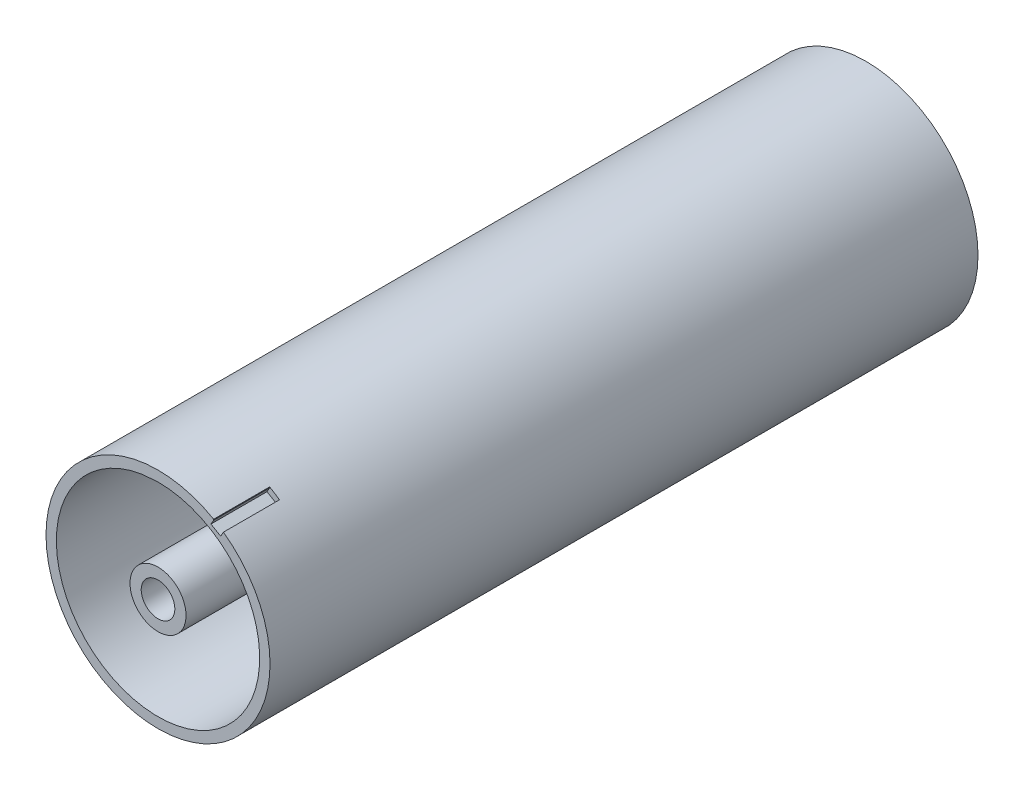
ISO-10303-21;
HEADER;
FILE_DESCRIPTION(('STEP AP214'),'2;1');
FILE_NAME('part.step','',(''),(''),'','','');
FILE_SCHEMA(('AUTOMOTIVE_DESIGN { 1 0 10303 214 1 1 1 1 }'));
ENDSEC;
DATA;
#1=APPLICATION_CONTEXT('core data for automotive mechanical design processes');
#2=APPLICATION_PROTOCOL_DEFINITION('international standard','automotive_design',2000,#1);
#3=PRODUCT_CONTEXT('',#1,'mechanical');
#4=PRODUCT('Part','Part','',(#3));
#5=PRODUCT_RELATED_PRODUCT_CATEGORY('part','',(#4));
#6=PRODUCT_DEFINITION_FORMATION('','',#4);
#7=PRODUCT_DEFINITION_CONTEXT('part definition',#1,'design');
#8=PRODUCT_DEFINITION('design','',#6,#7);
#9=PRODUCT_DEFINITION_SHAPE('','',#8);
#10=(LENGTH_UNIT() NAMED_UNIT(*) SI_UNIT(.MILLI.,.METRE.));
#11=(NAMED_UNIT(*) PLANE_ANGLE_UNIT() SI_UNIT($,.RADIAN.));
#12=(NAMED_UNIT(*) SI_UNIT($,.STERADIAN.) SOLID_ANGLE_UNIT());
#13=UNCERTAINTY_MEASURE_WITH_UNIT(LENGTH_MEASURE(1.E-05),#10,'distance_accuracy_value','');
#14=(GEOMETRIC_REPRESENTATION_CONTEXT(3) GLOBAL_UNCERTAINTY_ASSIGNED_CONTEXT((#13)) GLOBAL_UNIT_ASSIGNED_CONTEXT((#10,
#11,#12)) REPRESENTATION_CONTEXT('',''));
#15=CARTESIAN_POINT('',(0.,0.,0.));
#16=DIRECTION('',(0.,0.,1.));
#17=DIRECTION('',(1.,0.,0.));
#18=AXIS2_PLACEMENT_3D('',#15,#16,#17);
#19=CARTESIAN_POINT('',(0.,0.,53.257864376273));
#20=DIRECTION('',(0.,0.,1.));
#21=DIRECTION('',(1.,0.,0.));
#22=AXIS2_PLACEMENT_3D('',#19,#20,#21);
#23=CYLINDRICAL_SURFACE('',#22,4.99999999999862);
#24=CARTESIAN_POINT('',(0.,0.,126.4));
#25=DIRECTION('',(0.,0.,1.));
#26=DIRECTION('',(1.,0.,0.));
#27=AXIS2_PLACEMENT_3D('',#24,#25,#26);
#28=CIRCLE('',#27,4.99999999999862);
#29=CARTESIAN_POINT('',(4.99999999999862,0.,126.4));
#30=VERTEX_POINT('',#29);
#31=EDGE_CURVE('E55',#30,#30,#28,.T.);
#32=ORIENTED_EDGE('',*,*,#31,.F.);
#33=EDGE_LOOP('',(#32));
#34=FACE_BOUND('',#33,.T.);
#35=CARTESIAN_POINT('',(0.,0.,67.8));
#36=DIRECTION('',(0.,0.,-1.));
#37=DIRECTION('',(-1.,0.,0.));
#38=AXIS2_PLACEMENT_3D('',#35,#36,#37);
#39=CIRCLE('',#38,4.99999999999862);
#40=CARTESIAN_POINT('',(-4.99999999999862,0.,67.8));
#41=VERTEX_POINT('',#40);
#42=EDGE_CURVE('E51',#41,#41,#39,.F.);
#43=ORIENTED_EDGE('',*,*,#42,.T.);
#44=EDGE_LOOP('',(#43));
#45=FACE_BOUND('',#44,.T.);
#46=ADVANCED_FACE('F47',(#34,#45),#23,.T.);
#47=CARTESIAN_POINT('',(0.,0.,53.257864376273));
#48=DIRECTION('',(0.,0.,1.));
#49=DIRECTION('',(1.,0.,0.));
#50=AXIS2_PLACEMENT_3D('',#47,#48,#49);
#51=CYLINDRICAL_SURFACE('',#50,2.99999999999862);
#52=CARTESIAN_POINT('',(0.,0.,126.4));
#53=DIRECTION('',(0.,0.,1.));
#54=DIRECTION('',(1.,0.,0.));
#55=AXIS2_PLACEMENT_3D('',#52,#53,#54);
#56=CIRCLE('',#55,2.99999999999862);
#57=CARTESIAN_POINT('',(2.99999999999862,0.,126.4));
#58=VERTEX_POINT('',#57);
#59=EDGE_CURVE('E59',#58,#58,#56,.T.);
#60=ORIENTED_EDGE('',*,*,#59,.T.);
#61=EDGE_LOOP('',(#60));
#62=FACE_BOUND('',#61,.T.);
#63=CARTESIAN_POINT('',(0.,0.,67.8));
#64=DIRECTION('',(0.,0.,-1.));
#65=DIRECTION('',(-1.,0.,0.));
#66=AXIS2_PLACEMENT_3D('',#63,#64,#65);
#67=CIRCLE('',#66,2.99999999999862);
#68=CARTESIAN_POINT('',(-2.99999999999862,0.,67.8));
#69=VERTEX_POINT('',#68);
#70=EDGE_CURVE('E12',#69,#69,#67,.F.);
#71=ORIENTED_EDGE('',*,*,#70,.F.);
#72=EDGE_LOOP('',(#71));
#73=FACE_BOUND('',#72,.T.);
#74=ADVANCED_FACE('F74',(#62,#73),#51,.F.);
#75=CARTESIAN_POINT('',(0.,0.,126.4));
#76=DIRECTION('',(0.,0.,1.));
#77=DIRECTION('',(1.,0.,0.));
#78=AXIS2_PLACEMENT_3D('',#75,#76,#77);
#79=PLANE('',#78);
#80=ORIENTED_EDGE('',*,*,#59,.F.);
#81=EDGE_LOOP('',(#80));
#82=FACE_BOUND('',#81,.T.);
#83=ORIENTED_EDGE('',*,*,#31,.T.);
#84=EDGE_LOOP('',(#83));
#85=FACE_BOUND('',#84,.T.);
#86=ADVANCED_FACE('F70',(#82,#85),#79,.T.);
#87=CARTESIAN_POINT('',(0.,0.,67.8));
#88=DIRECTION('',(0.,0.,-1.));
#89=DIRECTION('',(-1.,0.,0.));
#90=AXIS2_PLACEMENT_3D('',#87,#88,#89);
#91=PLANE('',#90);
#92=ORIENTED_EDGE('',*,*,#42,.F.);
#93=EDGE_LOOP('',(#92));
#94=FACE_BOUND('',#93,.T.);
#95=ORIENTED_EDGE('',*,*,#70,.T.);
#96=EDGE_LOOP('',(#95));
#97=FACE_BOUND('',#96,.T.);
#98=ADVANCED_FACE('F49',(#94,#97),#91,.T.);
#99=CLOSED_SHELL('',(#46,#74,#86,#98));
#100=MANIFOLD_SOLID_BREP('B2',#99);
#101=CARTESIAN_POINT('',(-7.43671692188527,8.10526010833368,126.4));
#102=DIRECTION('',(0.,0.,-1.));
#103=DIRECTION('',(-1.,0.,0.));
#104=AXIS2_PLACEMENT_3D('',#101,#102,#103);
#105=CYLINDRICAL_SURFACE('',#104,6.);
#106=CARTESIAN_POINT('',(-7.43671692188527,8.10526010833368,67.4));
#107=DIRECTION('',(0.,0.,-1.));
#108=DIRECTION('',(-1.,0.,0.));
#109=AXIS2_PLACEMENT_3D('',#106,#107,#108);
#110=CIRCLE('',#109,6.);
#111=CARTESIAN_POINT('',(-1.51867853652908,9.09360299895954,67.4));
#112=VERTEX_POINT('',#111);
#113=CARTESIAN_POINT('',(-3.38032587358422,3.68420914015167,67.4));
#114=VERTEX_POINT('',#113);
#115=EDGE_CURVE('E256',#112,#114,#110,.T.);
#116=ORIENTED_EDGE('',*,*,#115,.F.);
#117=DIRECTION('',(0.,0.,-1.));
#118=VECTOR('',#117,1.);
#119=CARTESIAN_POINT('',(-1.51867853652908,9.09360299895954,126.4));
#120=LINE('',#119,#118);
#121=CARTESIAN_POINT('',(-1.51867853652908,9.09360299895954,59.));
#122=VERTEX_POINT('',#121);
#123=EDGE_CURVE('E133',#112,#122,#120,.T.);
#124=ORIENTED_EDGE('',*,*,#123,.T.);
#125=CARTESIAN_POINT('',(-7.43671692188527,8.10526010833368,59.));
#126=DIRECTION('',(0.,0.,-1.));
#127=DIRECTION('',(-1.,0.,0.));
#128=AXIS2_PLACEMENT_3D('',#125,#126,#127);
#129=CIRCLE('',#128,6.);
#130=CARTESIAN_POINT('',(-3.38032587358422,3.68420914015167,59.));
#131=VERTEX_POINT('',#130);
#132=EDGE_CURVE('E278',#122,#131,#129,.T.);
#133=ORIENTED_EDGE('',*,*,#132,.T.);
#134=DIRECTION('',(0.,0.,-1.));
#135=VECTOR('',#134,1.);
#136=CARTESIAN_POINT('',(-3.38032587358422,3.68420914015167,126.4));
#137=LINE('',#136,#135);
#138=EDGE_CURVE('E289',#114,#131,#137,.T.);
#139=ORIENTED_EDGE('',*,*,#138,.F.);
#140=EDGE_LOOP('',(#116,#124,#133,#139));
#141=FACE_BOUND('',#140,.T.);
#142=ADVANCED_FACE('F110',(#141),#105,.F.);
#143=CARTESIAN_POINT('',(0.,0.,126.4));
#144=DIRECTION('',(0.,0.,-1.));
#145=DIRECTION('',(-1.,0.,0.));
#146=AXIS2_PLACEMENT_3D('',#143,#144,#145);
#147=CYLINDRICAL_SURFACE('',#146,5.);
#148=CARTESIAN_POINT('',(0.,0.,67.4));
#149=DIRECTION('',(0.,0.,-1.));
#150=DIRECTION('',(-1.,0.,0.));
#151=AXIS2_PLACEMENT_3D('',#148,#149,#150);
#152=CIRCLE('',#151,5.);
#153=CARTESIAN_POINT('',(2.72727272727273,4.19070202604222,67.4));
#154=VERTEX_POINT('',#153);
#155=EDGE_CURVE('E258',#114,#154,#152,.F.);
#156=ORIENTED_EDGE('',*,*,#155,.F.);
#157=ORIENTED_EDGE('',*,*,#138,.T.);
#158=CARTESIAN_POINT('',(0.,0.,59.));
#159=DIRECTION('',(0.,0.,-1.));
#160=DIRECTION('',(-1.,0.,0.));
#161=AXIS2_PLACEMENT_3D('',#158,#159,#160);
#162=CIRCLE('',#161,5.);
#163=CARTESIAN_POINT('',(2.72727272727273,4.19070202604222,59.));
#164=VERTEX_POINT('',#163);
#165=EDGE_CURVE('E280',#131,#164,#162,.F.);
#166=ORIENTED_EDGE('',*,*,#165,.T.);
#167=DIRECTION('',(0.,0.,-1.));
#168=VECTOR('',#167,1.);
#169=CARTESIAN_POINT('',(2.72727272727273,4.19070202604222,126.4));
#170=LINE('',#169,#168);
#171=EDGE_CURVE('E292',#154,#164,#170,.T.);
#172=ORIENTED_EDGE('',*,*,#171,.F.);
#173=EDGE_LOOP('',(#156,#157,#166,#172));
#174=FACE_BOUND('',#173,.T.);
#175=ADVANCED_FACE('F337',(#174),#147,.T.);
#176=CARTESIAN_POINT('',(6.,9.21954445729289,126.4));
#177=DIRECTION('',(0.,0.,-1.));
#178=DIRECTION('',(-1.,0.,0.));
#179=AXIS2_PLACEMENT_3D('',#176,#177,#178);
#180=CYLINDRICAL_SURFACE('',#179,6.);
#181=CARTESIAN_POINT('',(6.,9.21954445729289,67.4));
#182=DIRECTION('',(0.,0.,-1.));
#183=DIRECTION('',(-1.,0.,0.));
#184=AXIS2_PLACEMENT_3D('',#181,#182,#183);
#185=CIRCLE('',#184,6.);
#186=CARTESIAN_POINT('',(0.,9.21954445729289,67.4));
#187=VERTEX_POINT('',#186);
#188=EDGE_CURVE('E260',#154,#187,#185,.T.);
#189=ORIENTED_EDGE('',*,*,#188,.F.);
#190=ORIENTED_EDGE('',*,*,#171,.T.);
#191=CARTESIAN_POINT('',(6.,9.21954445729289,59.));
#192=DIRECTION('',(0.,0.,-1.));
#193=DIRECTION('',(-1.,0.,0.));
#194=AXIS2_PLACEMENT_3D('',#191,#192,#193);
#195=CIRCLE('',#194,6.);
#196=CARTESIAN_POINT('',(0.,9.21954445729289,59.));
#197=VERTEX_POINT('',#196);
#198=EDGE_CURVE('E283',#164,#197,#195,.T.);
#199=ORIENTED_EDGE('',*,*,#198,.T.);
#200=DIRECTION('',(0.,0.,-1.));
#201=VECTOR('',#200,1.);
#202=CARTESIAN_POINT('',(0.,9.21954445729289,126.4));
#203=LINE('',#202,#201);
#204=EDGE_CURVE('E294',#187,#197,#203,.T.);
#205=ORIENTED_EDGE('',*,*,#204,.F.);
#206=EDGE_LOOP('',(#189,#190,#199,#205));
#207=FACE_BOUND('',#206,.T.);
#208=ADVANCED_FACE('F342',(#207),#180,.F.);
#209=CARTESIAN_POINT('',(0.,18.15,126.4));
#210=DIRECTION('',(1.,0.,0.));
#211=DIRECTION('',(0.,1.,0.));
#212=AXIS2_PLACEMENT_3D('',#209,#210,#211);
#213=PLANE('',#212);
#214=DIRECTION('',(0.,1.,0.));
#215=VECTOR('',#214,1.);
#216=CARTESIAN_POINT('',(0.,18.15,67.4));
#217=LINE('',#216,#215);
#218=CARTESIAN_POINT('',(0.,18.15,67.4));
#219=VERTEX_POINT('',#218);
#220=EDGE_CURVE('E262',#187,#219,#217,.T.);
#221=ORIENTED_EDGE('',*,*,#220,.F.);
#222=ORIENTED_EDGE('',*,*,#204,.T.);
#223=DIRECTION('',(0.,1.,0.));
#224=VECTOR('',#223,1.);
#225=CARTESIAN_POINT('',(0.,18.15,59.));
#226=LINE('',#225,#224);
#227=CARTESIAN_POINT('',(0.,18.15,59.));
#228=VERTEX_POINT('',#227);
#229=EDGE_CURVE('E286',#197,#228,#226,.T.);
#230=ORIENTED_EDGE('',*,*,#229,.T.);
#231=DIRECTION('',(0.,0.,-1.));
#232=VECTOR('',#231,1.);
#233=CARTESIAN_POINT('',(0.,18.15,126.4));
#234=LINE('',#233,#232);
#235=EDGE_CURVE('E299',#219,#228,#234,.T.);
#236=ORIENTED_EDGE('',*,*,#235,.F.);
#237=EDGE_LOOP('',(#221,#222,#230,#236));
#238=FACE_BOUND('',#237,.T.);
#239=ADVANCED_FACE('F380',(#238),#213,.T.);
#240=CARTESIAN_POINT('',(-2.98973724414323,17.9020661157025,126.4));
#241=DIRECTION('',(-0.986339730892699,-0.16472381510431,0.));
#242=DIRECTION('',(0.16472381510431,-0.986339730892699,0.));
#243=AXIS2_PLACEMENT_3D('',#240,#241,#242);
#244=PLANE('',#243);
#245=DIRECTION('',(0.16472381510431,-0.986339730892699,0.));
#246=VECTOR('',#245,1.);
#247=CARTESIAN_POINT('',(-2.98973724414323,17.9020661157025,67.4));
#248=LINE('',#247,#246);
#249=CARTESIAN_POINT('',(-2.98973724414323,17.9020661157025,67.4));
#250=VERTEX_POINT('',#249);
#251=EDGE_CURVE('E254',#250,#112,#248,.T.);
#252=ORIENTED_EDGE('',*,*,#251,.F.);
#253=DIRECTION('',(0.,0.,-1.));
#254=VECTOR('',#253,1.);
#255=CARTESIAN_POINT('',(-2.98973724414323,17.9020661157025,126.4));
#256=LINE('',#255,#254);
#257=CARTESIAN_POINT('',(-2.98973724414323,17.9020661157025,59.));
#258=VERTEX_POINT('',#257);
#259=EDGE_CURVE('E302',#250,#258,#256,.T.);
#260=ORIENTED_EDGE('',*,*,#259,.T.);
#261=DIRECTION('',(0.16472381510431,-0.986339730892699,0.));
#262=VECTOR('',#261,1.);
#263=CARTESIAN_POINT('',(-2.98973724414323,17.9020661157025,59.));
#264=LINE('',#263,#262);
#265=EDGE_CURVE('E275',#258,#122,#264,.T.);
#266=ORIENTED_EDGE('',*,*,#265,.T.);
#267=ORIENTED_EDGE('',*,*,#123,.F.);
#268=EDGE_LOOP('',(#252,#260,#266,#267));
#269=FACE_BOUND('',#268,.T.);
#270=ADVANCED_FACE('F347',(#269),#244,.T.);
#271=CARTESIAN_POINT('',(0.,0.,126.4));
#272=DIRECTION('',(0.,0.,-1.));
#273=DIRECTION('',(-1.,0.,0.));
#274=AXIS2_PLACEMENT_3D('',#271,#272,#273);
#275=CYLINDRICAL_SURFACE('',#274,3.);
#276=CARTESIAN_POINT('',(0.,0.,67.4));
#277=DIRECTION('',(0.,0.,-1.));
#278=DIRECTION('',(-1.,0.,0.));
#279=AXIS2_PLACEMENT_3D('',#276,#277,#278);
#280=CIRCLE('',#279,3.);
#281=CARTESIAN_POINT('',(-3.,0.,67.4));
#282=VERTEX_POINT('',#281);
#283=EDGE_CURVE('E250',#282,#282,#280,.F.);
#284=ORIENTED_EDGE('',*,*,#283,.T.);
#285=EDGE_LOOP('',(#284));
#286=FACE_BOUND('',#285,.T.);
#287=CARTESIAN_POINT('',(0.,0.,59.));
#288=DIRECTION('',(0.,0.,-1.));
#289=DIRECTION('',(-1.,0.,0.));
#290=AXIS2_PLACEMENT_3D('',#287,#288,#289);
#291=CIRCLE('',#290,3.);
#292=CARTESIAN_POINT('',(-3.,0.,59.));
#293=VERTEX_POINT('',#292);
#294=EDGE_CURVE('E273',#293,#293,#291,.F.);
#295=ORIENTED_EDGE('',*,*,#294,.F.);
#296=EDGE_LOOP('',(#295));
#297=FACE_BOUND('',#296,.T.);
#298=ADVANCED_FACE('F356',(#286,#297),#275,.F.);
#299=CARTESIAN_POINT('',(0.,0.,126.4));
#300=DIRECTION('',(0.,0.,1.));
#301=DIRECTION('',(1.,0.,0.));
#302=AXIS2_PLACEMENT_3D('',#299,#300,#301);
#303=PLANE('',#302);
#304=CARTESIAN_POINT('',(11.2461466911154,17.4788974583847,126.4));
#305=DIRECTION('',(0.,0.,1.));
#306=DIRECTION('',(-1.,0.,0.));
#307=AXIS2_PLACEMENT_3D('',#304,#305,#306);
#308=CIRCLE('',#307,1.31926101883654);
#309=CARTESIAN_POINT('',(9.93230749580876,17.3594143855345,126.4));
#310=VERTEX_POINT('',#309);
#311=CARTESIAN_POINT('',(9.94987437106606,17.2336879396141,126.4));
#312=VERTEX_POINT('',#311);
#313=EDGE_CURVE('E220',#310,#312,#308,.T.);
#314=ORIENTED_EDGE('',*,*,#313,.F.);
#315=CARTESIAN_POINT('',(0.,0.,126.4));
#316=DIRECTION('',(0.,0.,1.));
#317=DIRECTION('',(1.,0.,0.));
#318=AXIS2_PLACEMENT_3D('',#315,#316,#317);
#319=CIRCLE('',#318,20.);
#320=CARTESIAN_POINT('',(11.681925178635,16.2336879396142,126.4));
#321=VERTEX_POINT('',#320);
#322=EDGE_CURVE('E310',#310,#321,#319,.T.);
#323=ORIENTED_EDGE('',*,*,#322,.T.);
#324=DIRECTION('',(0.499999999999993,0.866025403784443,0.));
#325=VECTOR('',#324,1.);
#326=CARTESIAN_POINT('',(11.181925178635,15.3676625358297,126.4));
#327=LINE('',#326,#325);
#328=CARTESIAN_POINT('',(11.181925178635,15.3676625358297,126.4));
#329=VERTEX_POINT('',#328);
#330=EDGE_CURVE('E214',#329,#321,#327,.T.);
#331=ORIENTED_EDGE('',*,*,#330,.F.);
#332=DIRECTION('',(0.866025403784453,-0.499999999999976,0.));
#333=VECTOR('',#332,1.);
#334=CARTESIAN_POINT('',(9.44987437106607,16.3676625358297,126.4));
#335=LINE('',#334,#333);
#336=CARTESIAN_POINT('',(9.44987437106607,16.3676625358297,126.4));
#337=VERTEX_POINT('',#336);
#338=EDGE_CURVE('E236',#337,#329,#335,.T.);
#339=ORIENTED_EDGE('',*,*,#338,.F.);
#340=DIRECTION('',(-0.499999999999995,-0.866025403784442,0.));
#341=VECTOR('',#340,1.);
#342=CARTESIAN_POINT('',(9.94987437106606,17.2336879396141,126.4));
#343=LINE('',#342,#341);
#344=EDGE_CURVE('E234',#312,#337,#343,.T.);
#345=ORIENTED_EDGE('',*,*,#344,.F.);
#346=EDGE_LOOP('',(#314,#323,#331,#339,#345));
#347=FACE_BOUND('',#346,.T.);
#348=DIRECTION('',(-0.996579081381076,-0.0826446280991731,0.));
#349=VECTOR('',#348,1.);
#350=CARTESIAN_POINT('',(0.,18.15,126.4));
#351=LINE('',#350,#349);
#352=CARTESIAN_POINT('',(0.,18.15,126.4));
#353=VERTEX_POINT('',#352);
#354=CARTESIAN_POINT('',(-2.98973724414323,17.9020661157025,126.4));
#355=VERTEX_POINT('',#354);
#356=EDGE_CURVE('E243',#353,#355,#351,.T.);
#357=ORIENTED_EDGE('',*,*,#356,.F.);
#358=CARTESIAN_POINT('',(0.,0.,126.4));
#359=DIRECTION('',(0.,0.,1.));
#360=DIRECTION('',(1.,0.,0.));
#361=AXIS2_PLACEMENT_3D('',#358,#359,#360);
#362=CIRCLE('',#361,18.15);
#363=EDGE_CURVE('E304',#355,#353,#362,.T.);
#364=ORIENTED_EDGE('',*,*,#363,.F.);
#365=EDGE_LOOP('',(#357,#364));
#366=FACE_BOUND('',#365,.T.);
#367=ADVANCED_FACE('F320',(#347,#366),#303,.T.);
#368=CARTESIAN_POINT('',(0.,0.,0.));
#369=DIRECTION('',(0.,0.,1.));
#370=DIRECTION('',(1.,0.,0.));
#371=AXIS2_PLACEMENT_3D('',#368,#369,#370);
#372=PLANE('',#371);
#373=CARTESIAN_POINT('',(0.,0.,0.));
#374=DIRECTION('',(0.,0.,1.));
#375=DIRECTION('',(1.,0.,0.));
#376=AXIS2_PLACEMENT_3D('',#373,#374,#375);
#377=CIRCLE('',#376,20.);
#378=CARTESIAN_POINT('',(20.,0.,0.));
#379=VERTEX_POINT('',#378);
#380=EDGE_CURVE('E307',#379,#379,#377,.T.);
#381=ORIENTED_EDGE('',*,*,#380,.F.);
#382=EDGE_LOOP('',(#381));
#383=FACE_BOUND('',#382,.T.);
#384=CARTESIAN_POINT('',(0.,0.,0.));
#385=DIRECTION('',(0.,0.,1.));
#386=DIRECTION('',(1.,0.,0.));
#387=AXIS2_PLACEMENT_3D('',#384,#385,#386);
#388=CIRCLE('',#387,18.15);
#389=CARTESIAN_POINT('',(-2.98973724414323,17.9020661157025,0.));
#390=VERTEX_POINT('',#389);
#391=CARTESIAN_POINT('',(0.,18.15,0.));
#392=VERTEX_POINT('',#391);
#393=EDGE_CURVE('E291',#390,#392,#388,.T.);
#394=ORIENTED_EDGE('',*,*,#393,.T.);
#395=DIRECTION('',(0.996579081381076,0.0826446280991731,0.));
#396=VECTOR('',#395,1.);
#397=CARTESIAN_POINT('',(0.,18.15,0.));
#398=LINE('',#397,#396);
#399=EDGE_CURVE('E264',#390,#392,#398,.T.);
#400=ORIENTED_EDGE('',*,*,#399,.F.);
#401=EDGE_LOOP('',(#394,#400));
#402=FACE_BOUND('',#401,.T.);
#403=ADVANCED_FACE('F355',(#383,#402),#372,.F.);
#404=CARTESIAN_POINT('',(0.,0.,126.4));
#405=DIRECTION('',(0.,0.,-1.));
#406=DIRECTION('',(-1.,0.,0.));
#407=AXIS2_PLACEMENT_3D('',#404,#405,#406);
#408=CYLINDRICAL_SURFACE('',#407,20.);
#409=ORIENTED_EDGE('',*,*,#322,.F.);
#410=DIRECTION('',(0.,0.,1.));
#411=VECTOR('',#410,1.);
#412=CARTESIAN_POINT('',(9.93230749580876,17.3594143855345,121.4));
#413=LINE('',#412,#411);
#414=CARTESIAN_POINT('',(9.93230749580876,17.3594143855345,116.4));
#415=VERTEX_POINT('',#414);
#416=EDGE_CURVE('E45',#310,#415,#413,.F.);
#417=ORIENTED_EDGE('',*,*,#416,.T.);
#418=CARTESIAN_POINT('',(0.,0.,116.4));
#419=DIRECTION('',(0.,0.,-1.));
#420=DIRECTION('',(-1.,0.,0.));
#421=AXIS2_PLACEMENT_3D('',#418,#419,#420);
#422=CIRCLE('',#421,20.);
#423=CARTESIAN_POINT('',(11.681925178635,16.2336879396142,116.4));
#424=VERTEX_POINT('',#423);
#425=EDGE_CURVE('E118',#415,#424,#422,.T.);
#426=ORIENTED_EDGE('',*,*,#425,.T.);
#427=DIRECTION('',(0.,0.,1.));
#428=VECTOR('',#427,1.);
#429=CARTESIAN_POINT('',(11.681925178635,16.2336879396142,116.4));
#430=LINE('',#429,#428);
#431=EDGE_CURVE('E240',#424,#321,#430,.T.);
#432=ORIENTED_EDGE('',*,*,#431,.T.);
#433=EDGE_LOOP('',(#409,#417,#426,#432));
#434=FACE_BOUND('',#433,.T.);
#435=ORIENTED_EDGE('',*,*,#380,.T.);
#436=EDGE_LOOP('',(#435));
#437=FACE_BOUND('',#436,.T.);
#438=ADVANCED_FACE('F112',(#434,#437),#408,.T.);
#439=CARTESIAN_POINT('',(0.,0.,126.4));
#440=DIRECTION('',(0.,0.,-1.));
#441=DIRECTION('',(-1.,0.,0.));
#442=AXIS2_PLACEMENT_3D('',#439,#440,#441);
#443=CYLINDRICAL_SURFACE('',#442,18.15);
#444=ORIENTED_EDGE('',*,*,#259,.F.);
#445=EDGE_CURVE('E300',#355,#250,#256,.T.);
#446=ORIENTED_EDGE('',*,*,#445,.F.);
#447=ORIENTED_EDGE('',*,*,#363,.T.);
#448=EDGE_CURVE('E296',#353,#219,#234,.T.);
#449=ORIENTED_EDGE('',*,*,#448,.T.);
#450=ORIENTED_EDGE('',*,*,#235,.T.);
#451=DIRECTION('',(0.,0.,-1.));
#452=VECTOR('',#451,1.);
#453=CARTESIAN_POINT('',(0.,18.15,59.));
#454=LINE('',#453,#452);
#455=EDGE_CURVE('E270',#228,#392,#454,.T.);
#456=ORIENTED_EDGE('',*,*,#455,.T.);
#457=ORIENTED_EDGE('',*,*,#393,.F.);
#458=DIRECTION('',(0.,0.,-1.));
#459=VECTOR('',#458,1.);
#460=CARTESIAN_POINT('',(-2.98973724414323,17.9020661157025,59.));
#461=LINE('',#460,#459);
#462=EDGE_CURVE('E268',#258,#390,#461,.T.);
#463=ORIENTED_EDGE('',*,*,#462,.F.);
#464=EDGE_LOOP('',(#444,#446,#447,#449,#450,#456,#457,#463));
#465=FACE_BOUND('',#464,.T.);
#466=ADVANCED_FACE('F349',(#465),#443,.F.);
#467=CARTESIAN_POINT('',(0.,0.,59.));
#468=DIRECTION('',(0.,0.,-1.));
#469=DIRECTION('',(-1.,0.,0.));
#470=AXIS2_PLACEMENT_3D('',#467,#468,#469);
#471=PLANE('',#470);
#472=ORIENTED_EDGE('',*,*,#198,.F.);
#473=ORIENTED_EDGE('',*,*,#165,.F.);
#474=ORIENTED_EDGE('',*,*,#132,.F.);
#475=ORIENTED_EDGE('',*,*,#265,.F.);
#476=DIRECTION('',(0.996579081381076,0.0826446280991731,0.));
#477=VECTOR('',#476,1.);
#478=CARTESIAN_POINT('',(0.,18.15,59.));
#479=LINE('',#478,#477);
#480=EDGE_CURVE('E265',#258,#228,#479,.T.);
#481=ORIENTED_EDGE('',*,*,#480,.T.);
#482=ORIENTED_EDGE('',*,*,#229,.F.);
#483=EDGE_LOOP('',(#472,#473,#474,#475,#481,#482));
#484=FACE_BOUND('',#483,.T.);
#485=ORIENTED_EDGE('',*,*,#294,.T.);
#486=EDGE_LOOP('',(#485));
#487=FACE_BOUND('',#486,.T.);
#488=ADVANCED_FACE('F352',(#484,#487),#471,.T.);
#489=CARTESIAN_POINT('',(0.,18.15,59.));
#490=DIRECTION('',(-0.0826446280991731,0.996579081381076,0.));
#491=DIRECTION('',(-0.996579081381076,-0.0826446280991731,0.));
#492=AXIS2_PLACEMENT_3D('',#489,#490,#491);
#493=PLANE('',#492);
#494=ORIENTED_EDGE('',*,*,#399,.T.);
#495=ORIENTED_EDGE('',*,*,#455,.F.);
#496=ORIENTED_EDGE('',*,*,#480,.F.);
#497=ORIENTED_EDGE('',*,*,#462,.T.);
#498=EDGE_LOOP('',(#494,#495,#496,#497));
#499=FACE_BOUND('',#498,.T.);
#500=ADVANCED_FACE('F372',(#499),#493,.F.);
#501=CARTESIAN_POINT('',(0.,0.,67.4));
#502=DIRECTION('',(0.,0.,-1.));
#503=DIRECTION('',(-1.,0.,0.));
#504=AXIS2_PLACEMENT_3D('',#501,#502,#503);
#505=PLANE('',#504);
#506=ORIENTED_EDGE('',*,*,#220,.T.);
#507=DIRECTION('',(-0.996579081381076,-0.0826446280991731,0.));
#508=VECTOR('',#507,1.);
#509=CARTESIAN_POINT('',(0.,18.15,67.4));
#510=LINE('',#509,#508);
#511=EDGE_CURVE('E247',#219,#250,#510,.T.);
#512=ORIENTED_EDGE('',*,*,#511,.T.);
#513=ORIENTED_EDGE('',*,*,#251,.T.);
#514=ORIENTED_EDGE('',*,*,#115,.T.);
#515=ORIENTED_EDGE('',*,*,#155,.T.);
#516=ORIENTED_EDGE('',*,*,#188,.T.);
#517=EDGE_LOOP('',(#506,#512,#513,#514,#515,#516));
#518=FACE_BOUND('',#517,.T.);
#519=ORIENTED_EDGE('',*,*,#283,.F.);
#520=EDGE_LOOP('',(#519));
#521=FACE_BOUND('',#520,.T.);
#522=ADVANCED_FACE('F397',(#518,#521),#505,.F.);
#523=CARTESIAN_POINT('',(0.,18.15,67.4));
#524=DIRECTION('',(-0.0826446280991732,0.996579081381076,0.));
#525=DIRECTION('',(-0.996579081381076,-0.0826446280991732,0.));
#526=AXIS2_PLACEMENT_3D('',#523,#524,#525);
#527=PLANE('',#526);
#528=ORIENTED_EDGE('',*,*,#356,.T.);
#529=ORIENTED_EDGE('',*,*,#445,.T.);
#530=ORIENTED_EDGE('',*,*,#511,.F.);
#531=ORIENTED_EDGE('',*,*,#448,.F.);
#532=EDGE_LOOP('',(#528,#529,#530,#531));
#533=FACE_BOUND('',#532,.T.);
#534=ADVANCED_FACE('F395',(#533),#527,.F.);
#535=CARTESIAN_POINT('',(11.2461466911154,17.4788974583847,116.4));
#536=DIRECTION('',(0.,0.,1.));
#537=DIRECTION('',(1.,0.,0.));
#538=AXIS2_PLACEMENT_3D('',#535,#536,#537);
#539=CYLINDRICAL_SURFACE('',#538,1.31926101883654);
#540=ORIENTED_EDGE('',*,*,#313,.T.);
#541=DIRECTION('',(0.,0.,1.));
#542=VECTOR('',#541,1.);
#543=CARTESIAN_POINT('',(9.94987437106606,17.2336879396141,116.4));
#544=LINE('',#543,#542);
#545=CARTESIAN_POINT('',(9.94987437106606,17.2336879396141,116.4));
#546=VERTEX_POINT('',#545);
#547=EDGE_CURVE('E217',#546,#312,#544,.T.);
#548=ORIENTED_EDGE('',*,*,#547,.F.);
#549=CARTESIAN_POINT('',(11.2461466911154,17.4788974583847,116.4));
#550=DIRECTION('',(0.,0.,1.));
#551=DIRECTION('',(-1.,0.,0.));
#552=AXIS2_PLACEMENT_3D('',#549,#550,#551);
#553=CIRCLE('',#552,1.31926101883654);
#554=EDGE_CURVE('E207',#415,#546,#553,.T.);
#555=ORIENTED_EDGE('',*,*,#554,.F.);
#556=ORIENTED_EDGE('',*,*,#416,.F.);
#557=EDGE_LOOP('',(#540,#548,#555,#556));
#558=FACE_BOUND('',#557,.T.);
#559=ADVANCED_FACE('F218',(#558),#539,.F.);
#560=CARTESIAN_POINT('',(11.2461466911154,17.4788974583847,116.4));
#561=DIRECTION('',(0.,0.,-1.));
#562=DIRECTION('',(-1.,0.,0.));
#563=AXIS2_PLACEMENT_3D('',#560,#561,#562);
#564=PLANE('',#563);
#565=ORIENTED_EDGE('',*,*,#554,.T.);
#566=DIRECTION('',(-0.499999999999995,-0.866025403784442,0.));
#567=VECTOR('',#566,1.);
#568=CARTESIAN_POINT('',(9.94987437106606,17.2336879396141,116.4));
#569=LINE('',#568,#567);
#570=CARTESIAN_POINT('',(9.44987437106607,16.3676625358297,116.4));
#571=VERTEX_POINT('',#570);
#572=EDGE_CURVE('E211',#546,#571,#569,.T.);
#573=ORIENTED_EDGE('',*,*,#572,.T.);
#574=DIRECTION('',(0.866025403784453,-0.499999999999976,0.));
#575=VECTOR('',#574,1.);
#576=CARTESIAN_POINT('',(9.44987437106607,16.3676625358297,116.4));
#577=LINE('',#576,#575);
#578=CARTESIAN_POINT('',(11.181925178635,15.3676625358297,116.4));
#579=VERTEX_POINT('',#578);
#580=EDGE_CURVE('E228',#571,#579,#577,.T.);
#581=ORIENTED_EDGE('',*,*,#580,.T.);
#582=DIRECTION('',(0.499999999999993,0.866025403784443,0.));
#583=VECTOR('',#582,1.);
#584=CARTESIAN_POINT('',(11.181925178635,15.3676625358297,116.4));
#585=LINE('',#584,#583);
#586=EDGE_CURVE('E125',#579,#424,#585,.T.);
#587=ORIENTED_EDGE('',*,*,#586,.T.);
#588=ORIENTED_EDGE('',*,*,#425,.F.);
#589=EDGE_LOOP('',(#565,#573,#581,#587,#588));
#590=FACE_BOUND('',#589,.T.);
#591=ADVANCED_FACE('F209',(#590),#564,.F.);
#592=CARTESIAN_POINT('',(11.181925178635,15.3676625358297,116.4));
#593=DIRECTION('',(0.866025403784443,-0.499999999999993,0.));
#594=DIRECTION('',(0.499999999999993,0.866025403784443,0.));
#595=AXIS2_PLACEMENT_3D('',#592,#593,#594);
#596=PLANE('',#595);
#597=ORIENTED_EDGE('',*,*,#330,.T.);
#598=ORIENTED_EDGE('',*,*,#431,.F.);
#599=ORIENTED_EDGE('',*,*,#586,.F.);
#600=DIRECTION('',(0.,0.,1.));
#601=VECTOR('',#600,1.);
#602=CARTESIAN_POINT('',(11.181925178635,15.3676625358297,116.4));
#603=LINE('',#602,#601);
#604=EDGE_CURVE('E244',#579,#329,#603,.T.);
#605=ORIENTED_EDGE('',*,*,#604,.T.);
#606=EDGE_LOOP('',(#597,#598,#599,#605));
#607=FACE_BOUND('',#606,.T.);
#608=ADVANCED_FACE('F327',(#607),#596,.F.);
#609=CARTESIAN_POINT('',(9.44987437106607,16.3676625358297,116.4));
#610=DIRECTION('',(-0.499999999999976,-0.866025403784453,0.));
#611=DIRECTION('',(0.866025403784453,-0.499999999999976,0.));
#612=AXIS2_PLACEMENT_3D('',#609,#610,#611);
#613=PLANE('',#612);
#614=ORIENTED_EDGE('',*,*,#338,.T.);
#615=ORIENTED_EDGE('',*,*,#604,.F.);
#616=ORIENTED_EDGE('',*,*,#580,.F.);
#617=DIRECTION('',(0.,0.,1.));
#618=VECTOR('',#617,1.);
#619=CARTESIAN_POINT('',(9.44987437106607,16.3676625358297,116.4));
#620=LINE('',#619,#618);
#621=EDGE_CURVE('E224',#571,#337,#620,.T.);
#622=ORIENTED_EDGE('',*,*,#621,.T.);
#623=EDGE_LOOP('',(#614,#615,#616,#622));
#624=FACE_BOUND('',#623,.T.);
#625=ADVANCED_FACE('F325',(#624),#613,.F.);
#626=CARTESIAN_POINT('',(9.94987437106606,17.2336879396141,116.4));
#627=DIRECTION('',(-0.866025403784442,0.499999999999995,0.));
#628=DIRECTION('',(-0.499999999999995,-0.866025403784442,0.));
#629=AXIS2_PLACEMENT_3D('',#626,#627,#628);
#630=PLANE('',#629);
#631=ORIENTED_EDGE('',*,*,#344,.T.);
#632=ORIENTED_EDGE('',*,*,#621,.F.);
#633=ORIENTED_EDGE('',*,*,#572,.F.);
#634=ORIENTED_EDGE('',*,*,#547,.T.);
#635=EDGE_LOOP('',(#631,#632,#633,#634));
#636=FACE_BOUND('',#635,.T.);
#637=ADVANCED_FACE('F226',(#636),#630,.F.);
#638=CLOSED_SHELL('',(#142,#175,#208,#239,#270,#298,#367,#403,#438,#466,#488,#500,#522,#534,
#559,#591,#608,#625,#637));
#639=MANIFOLD_SOLID_BREP('B7',#638);
#640=ADVANCED_BREP_SHAPE_REPRESENTATION('',(#18,#100,#639),#14);
#641=SHAPE_DEFINITION_REPRESENTATION(#9,#640);
ENDSEC;
END-ISO-10303-21;
